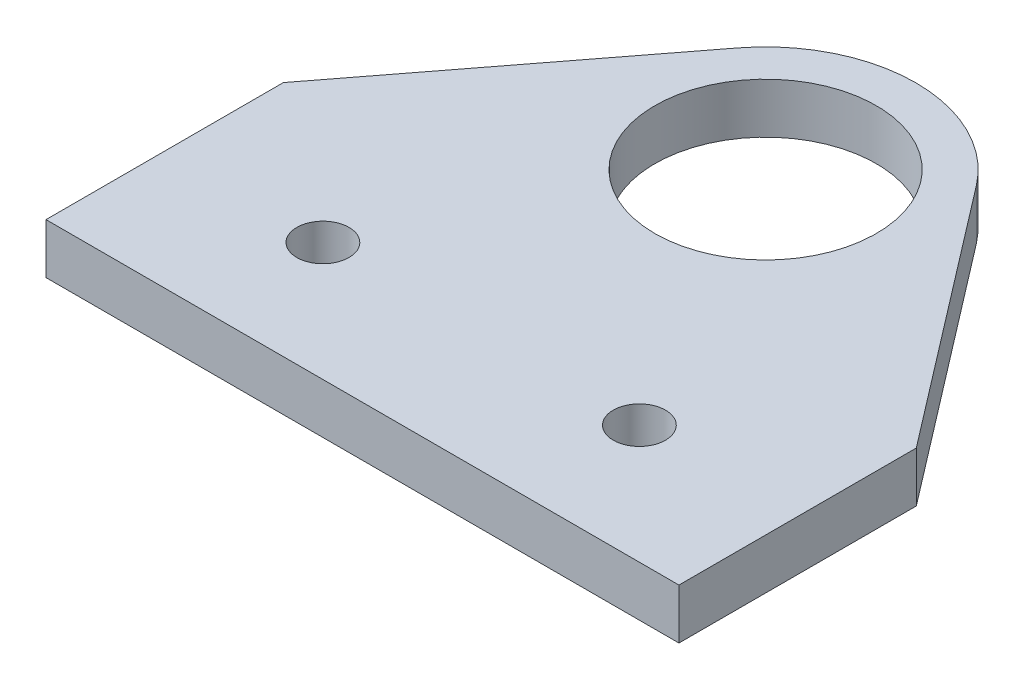
ISO-10303-21;
HEADER;
FILE_DESCRIPTION(('STEP AP214'),'2;1');
FILE_NAME('part.step','',(''),(''),'','','');
FILE_SCHEMA(('AUTOMOTIVE_DESIGN { 1 0 10303 214 1 1 1 1 }'));
ENDSEC;
DATA;
#1=APPLICATION_CONTEXT('core data for automotive mechanical design processes');
#2=APPLICATION_PROTOCOL_DEFINITION('international standard','automotive_design',2000,#1);
#3=PRODUCT_CONTEXT('',#1,'mechanical');
#4=PRODUCT('Part','Part','',(#3));
#5=PRODUCT_RELATED_PRODUCT_CATEGORY('part','',(#4));
#6=PRODUCT_DEFINITION_FORMATION('','',#4);
#7=PRODUCT_DEFINITION_CONTEXT('part definition',#1,'design');
#8=PRODUCT_DEFINITION('design','',#6,#7);
#9=PRODUCT_DEFINITION_SHAPE('','',#8);
#10=(LENGTH_UNIT() NAMED_UNIT(*) SI_UNIT(.MILLI.,.METRE.));
#11=(NAMED_UNIT(*) PLANE_ANGLE_UNIT() SI_UNIT($,.RADIAN.));
#12=(NAMED_UNIT(*) SI_UNIT($,.STERADIAN.) SOLID_ANGLE_UNIT());
#13=UNCERTAINTY_MEASURE_WITH_UNIT(LENGTH_MEASURE(1.E-05),#10,'distance_accuracy_value','');
#14=(GEOMETRIC_REPRESENTATION_CONTEXT(3) GLOBAL_UNCERTAINTY_ASSIGNED_CONTEXT((#13)) GLOBAL_UNIT_ASSIGNED_CONTEXT((#10,
#11,#12)) REPRESENTATION_CONTEXT('',''));
#15=CARTESIAN_POINT('',(0.,0.,0.));
#16=DIRECTION('',(0.,0.,1.));
#17=DIRECTION('',(1.,0.,0.));
#18=AXIS2_PLACEMENT_3D('',#15,#16,#17);
#19=CARTESIAN_POINT('',(0.,6.35,15.));
#20=DIRECTION('',(0.,0.,-1.));
#21=DIRECTION('',(-1.,0.,0.));
#22=AXIS2_PLACEMENT_3D('',#19,#20,#21);
#23=PLANE('',#22);
#24=DIRECTION('',(1.,0.,0.));
#25=VECTOR('',#24,1.);
#26=CARTESIAN_POINT('',(0.,0.,15.));
#27=LINE('',#26,#25);
#28=CARTESIAN_POINT('',(-40.,0.,15.));
#29=VERTEX_POINT('',#28);
#30=CARTESIAN_POINT('',(40.,0.,15.));
#31=VERTEX_POINT('',#30);
#32=EDGE_CURVE('E124',#29,#31,#27,.T.);
#33=ORIENTED_EDGE('',*,*,#32,.T.);
#34=DIRECTION('',(0.,-1.,0.));
#35=VECTOR('',#34,1.);
#36=CARTESIAN_POINT('',(40.,6.35,15.));
#37=LINE('',#36,#35);
#38=CARTESIAN_POINT('',(40.,6.35,15.));
#39=VERTEX_POINT('',#38);
#40=EDGE_CURVE('E11',#39,#31,#37,.T.);
#41=ORIENTED_EDGE('',*,*,#40,.F.);
#42=DIRECTION('',(1.,0.,0.));
#43=VECTOR('',#42,1.);
#44=CARTESIAN_POINT('',(0.,6.35,15.));
#45=LINE('',#44,#43);
#46=CARTESIAN_POINT('',(-40.,6.35,15.));
#47=VERTEX_POINT('',#46);
#48=EDGE_CURVE('E140',#47,#39,#45,.T.);
#49=ORIENTED_EDGE('',*,*,#48,.F.);
#50=DIRECTION('',(0.,-1.,0.));
#51=VECTOR('',#50,1.);
#52=CARTESIAN_POINT('',(-40.,6.35,15.));
#53=LINE('',#52,#51);
#54=EDGE_CURVE('E51',#47,#29,#53,.T.);
#55=ORIENTED_EDGE('',*,*,#54,.T.);
#56=EDGE_LOOP('',(#33,#41,#49,#55));
#57=FACE_BOUND('',#56,.T.);
#58=ADVANCED_FACE('F35',(#57),#23,.F.);
#59=CARTESIAN_POINT('',(40.,6.35,0.));
#60=DIRECTION('',(-1.,0.,0.));
#61=DIRECTION('',(0.,0.,1.));
#62=AXIS2_PLACEMENT_3D('',#59,#60,#61);
#63=PLANE('',#62);
#64=DIRECTION('',(0.,0.,-1.));
#65=VECTOR('',#64,1.);
#66=CARTESIAN_POINT('',(40.,0.,0.));
#67=LINE('',#66,#65);
#68=CARTESIAN_POINT('',(40.,0.,-15.));
#69=VERTEX_POINT('',#68);
#70=EDGE_CURVE('E126',#31,#69,#67,.T.);
#71=ORIENTED_EDGE('',*,*,#70,.T.);
#72=DIRECTION('',(0.,-1.,0.));
#73=VECTOR('',#72,1.);
#74=CARTESIAN_POINT('',(40.,6.35,-15.));
#75=LINE('',#74,#73);
#76=CARTESIAN_POINT('',(40.,6.35,-15.));
#77=VERTEX_POINT('',#76);
#78=EDGE_CURVE('E43',#77,#69,#75,.T.);
#79=ORIENTED_EDGE('',*,*,#78,.F.);
#80=DIRECTION('',(0.,0.,-1.));
#81=VECTOR('',#80,1.);
#82=CARTESIAN_POINT('',(40.,6.35,0.));
#83=LINE('',#82,#81);
#84=EDGE_CURVE('E83',#39,#77,#83,.T.);
#85=ORIENTED_EDGE('',*,*,#84,.F.);
#86=ORIENTED_EDGE('',*,*,#40,.T.);
#87=EDGE_LOOP('',(#71,#79,#85,#86));
#88=FACE_BOUND('',#87,.T.);
#89=ADVANCED_FACE('F162',(#88),#63,.F.);
#90=CARTESIAN_POINT('',(32.4372928552907,6.35,-24.865590874823));
#91=DIRECTION('',(-0.79364180564368,0.,0.608385309104879));
#92=DIRECTION('',(0.608385309104879,0.,0.79364180564368));
#93=AXIS2_PLACEMENT_3D('',#90,#91,#92);
#94=PLANE('',#93);
#95=DIRECTION('',(-0.608385309104879,0.,-0.79364180564368));
#96=VECTOR('',#95,1.);
#97=CARTESIAN_POINT('',(32.4372928552907,0.,-24.865590874823));
#98=LINE('',#97,#96);
#99=CARTESIAN_POINT('',(15.0791943072299,0.,-47.5093208729927));
#100=VERTEX_POINT('',#99);
#101=EDGE_CURVE('E129',#69,#100,#98,.T.);
#102=ORIENTED_EDGE('',*,*,#101,.T.);
#103=DIRECTION('',(0.,-1.,0.));
#104=VECTOR('',#103,1.);
#105=CARTESIAN_POINT('',(15.0791943072299,6.35,-47.5093208729927));
#106=LINE('',#105,#104);
#107=CARTESIAN_POINT('',(15.0791943072299,6.35,-47.5093208729927));
#108=VERTEX_POINT('',#107);
#109=EDGE_CURVE('E113',#108,#100,#106,.T.);
#110=ORIENTED_EDGE('',*,*,#109,.F.);
#111=DIRECTION('',(-0.608385309104879,0.,-0.79364180564368));
#112=VECTOR('',#111,1.);
#113=CARTESIAN_POINT('',(32.4372928552907,6.35,-24.865590874823));
#114=LINE('',#113,#112);
#115=EDGE_CURVE('E101',#77,#108,#114,.T.);
#116=ORIENTED_EDGE('',*,*,#115,.F.);
#117=ORIENTED_EDGE('',*,*,#78,.T.);
#118=EDGE_LOOP('',(#102,#110,#116,#117));
#119=FACE_BOUND('',#118,.T.);
#120=ADVANCED_FACE('F146',(#119),#94,.F.);
#121=CARTESIAN_POINT('',(0.,6.35,-35.95));
#122=DIRECTION('',(0.,-1.,0.));
#123=DIRECTION('',(0.,0.,-1.));
#124=AXIS2_PLACEMENT_3D('',#121,#122,#123);
#125=CYLINDRICAL_SURFACE('',#124,19.);
#126=CARTESIAN_POINT('',(0.,0.,-35.95));
#127=DIRECTION('',(0.,1.,0.));
#128=DIRECTION('',(0.,0.,1.));
#129=AXIS2_PLACEMENT_3D('',#126,#127,#128);
#130=CIRCLE('',#129,19.);
#131=CARTESIAN_POINT('',(-15.0791943072299,0.,-47.5093208729927));
#132=VERTEX_POINT('',#131);
#133=EDGE_CURVE('E110',#100,#132,#130,.T.);
#134=ORIENTED_EDGE('',*,*,#133,.T.);
#135=DIRECTION('',(0.,-1.,0.));
#136=VECTOR('',#135,1.);
#137=CARTESIAN_POINT('',(-15.0791943072299,6.35,-47.5093208729927));
#138=LINE('',#137,#136);
#139=CARTESIAN_POINT('',(-15.0791943072299,6.35,-47.5093208729927));
#140=VERTEX_POINT('',#139);
#141=EDGE_CURVE('E107',#140,#132,#138,.T.);
#142=ORIENTED_EDGE('',*,*,#141,.F.);
#143=CARTESIAN_POINT('',(0.,6.35,-35.95));
#144=DIRECTION('',(0.,1.,0.));
#145=DIRECTION('',(0.,0.,1.));
#146=AXIS2_PLACEMENT_3D('',#143,#144,#145);
#147=CIRCLE('',#146,19.);
#148=EDGE_CURVE('E93',#108,#140,#147,.T.);
#149=ORIENTED_EDGE('',*,*,#148,.F.);
#150=ORIENTED_EDGE('',*,*,#109,.T.);
#151=EDGE_LOOP('',(#134,#142,#149,#150));
#152=FACE_BOUND('',#151,.T.);
#153=ADVANCED_FACE('F108',(#152),#125,.T.);
#154=CARTESIAN_POINT('',(-32.4372928552907,6.35,-24.865590874823));
#155=DIRECTION('',(-0.79364180564368,0.,-0.608385309104879));
#156=DIRECTION('',(-0.608385309104879,0.,0.79364180564368));
#157=AXIS2_PLACEMENT_3D('',#154,#155,#156);
#158=PLANE('',#157);
#159=DIRECTION('',(0.608385309104879,0.,-0.79364180564368));
#160=VECTOR('',#159,1.);
#161=CARTESIAN_POINT('',(-32.4372928552907,0.,-24.865590874823));
#162=LINE('',#161,#160);
#163=CARTESIAN_POINT('',(-40.,0.,-15.));
#164=VERTEX_POINT('',#163);
#165=EDGE_CURVE('E132',#164,#132,#162,.T.);
#166=ORIENTED_EDGE('',*,*,#165,.F.);
#167=DIRECTION('',(0.,-1.,0.));
#168=VECTOR('',#167,1.);
#169=CARTESIAN_POINT('',(-40.,6.35,-15.));
#170=LINE('',#169,#168);
#171=CARTESIAN_POINT('',(-40.,6.35,-15.));
#172=VERTEX_POINT('',#171);
#173=EDGE_CURVE('E71',#172,#164,#170,.T.);
#174=ORIENTED_EDGE('',*,*,#173,.F.);
#175=DIRECTION('',(0.608385309104879,0.,-0.79364180564368));
#176=VECTOR('',#175,1.);
#177=CARTESIAN_POINT('',(-32.4372928552907,6.35,-24.865590874823));
#178=LINE('',#177,#176);
#179=EDGE_CURVE('E99',#172,#140,#178,.T.);
#180=ORIENTED_EDGE('',*,*,#179,.T.);
#181=ORIENTED_EDGE('',*,*,#141,.T.);
#182=EDGE_LOOP('',(#166,#174,#180,#181));
#183=FACE_BOUND('',#182,.T.);
#184=ADVANCED_FACE('F115',(#183),#158,.T.);
#185=CARTESIAN_POINT('',(-40.,6.35,0.));
#186=DIRECTION('',(-1.,0.,0.));
#187=DIRECTION('',(0.,0.,1.));
#188=AXIS2_PLACEMENT_3D('',#185,#186,#187);
#189=PLANE('',#188);
#190=DIRECTION('',(0.,0.,-1.));
#191=VECTOR('',#190,1.);
#192=CARTESIAN_POINT('',(-40.,0.,0.));
#193=LINE('',#192,#191);
#194=EDGE_CURVE('E134',#29,#164,#193,.T.);
#195=ORIENTED_EDGE('',*,*,#194,.F.);
#196=ORIENTED_EDGE('',*,*,#54,.F.);
#197=DIRECTION('',(0.,0.,-1.));
#198=VECTOR('',#197,1.);
#199=CARTESIAN_POINT('',(-40.,6.35,0.));
#200=LINE('',#199,#198);
#201=EDGE_CURVE('E116',#47,#172,#200,.T.);
#202=ORIENTED_EDGE('',*,*,#201,.T.);
#203=ORIENTED_EDGE('',*,*,#173,.T.);
#204=EDGE_LOOP('',(#195,#196,#202,#203));
#205=FACE_BOUND('',#204,.T.);
#206=ADVANCED_FACE('F150',(#205),#189,.T.);
#207=CARTESIAN_POINT('',(0.,6.35,-35.95));
#208=DIRECTION('',(0.,-1.,0.));
#209=DIRECTION('',(0.,0.,-1.));
#210=AXIS2_PLACEMENT_3D('',#207,#208,#209);
#211=CYLINDRICAL_SURFACE('',#210,14.);
#212=CARTESIAN_POINT('',(0.,6.35,-35.95));
#213=DIRECTION('',(0.,1.,0.));
#214=DIRECTION('',(0.,0.,1.));
#215=AXIS2_PLACEMENT_3D('',#212,#213,#214);
#216=CIRCLE('',#215,14.);
#217=CARTESIAN_POINT('',(0.,6.35,-21.95));
#218=VERTEX_POINT('',#217);
#219=EDGE_CURVE('E118',#218,#218,#216,.T.);
#220=ORIENTED_EDGE('',*,*,#219,.T.);
#221=EDGE_LOOP('',(#220));
#222=FACE_BOUND('',#221,.T.);
#223=CARTESIAN_POINT('',(0.,0.,-35.95));
#224=DIRECTION('',(0.,1.,0.));
#225=DIRECTION('',(0.,0.,1.));
#226=AXIS2_PLACEMENT_3D('',#223,#224,#225);
#227=CIRCLE('',#226,14.);
#228=CARTESIAN_POINT('',(0.,0.,-21.95));
#229=VERTEX_POINT('',#228);
#230=EDGE_CURVE('E137',#229,#229,#227,.T.);
#231=ORIENTED_EDGE('',*,*,#230,.F.);
#232=EDGE_LOOP('',(#231));
#233=FACE_BOUND('',#232,.T.);
#234=ADVANCED_FACE('F152',(#222,#233),#211,.F.);
#235=CARTESIAN_POINT('',(0.,6.35,0.));
#236=DIRECTION('',(0.,1.,0.));
#237=DIRECTION('',(0.,0.,1.));
#238=AXIS2_PLACEMENT_3D('',#235,#236,#237);
#239=PLANE('',#238);
#240=CARTESIAN_POINT('',(-20.,6.35,0.));
#241=DIRECTION('',(0.,1.,0.));
#242=DIRECTION('',(0.,0.,1.));
#243=AXIS2_PLACEMENT_3D('',#240,#241,#242);
#244=CIRCLE('',#243,3.29999999999999);
#245=CARTESIAN_POINT('',(-20.,6.35,3.29999999999999));
#246=VERTEX_POINT('',#245);
#247=EDGE_CURVE('E178',#246,#246,#244,.T.);
#248=ORIENTED_EDGE('',*,*,#247,.F.);
#249=EDGE_LOOP('',(#248));
#250=FACE_BOUND('',#249,.T.);
#251=CARTESIAN_POINT('',(20.,6.35,0.));
#252=DIRECTION('',(0.,1.,0.));
#253=DIRECTION('',(0.,0.,1.));
#254=AXIS2_PLACEMENT_3D('',#251,#252,#253);
#255=CIRCLE('',#254,3.29999999999999);
#256=CARTESIAN_POINT('',(20.,6.35,3.29999999999999));
#257=VERTEX_POINT('',#256);
#258=EDGE_CURVE('E172',#257,#257,#255,.T.);
#259=ORIENTED_EDGE('',*,*,#258,.F.);
#260=EDGE_LOOP('',(#259));
#261=FACE_BOUND('',#260,.T.);
#262=ORIENTED_EDGE('',*,*,#48,.T.);
#263=ORIENTED_EDGE('',*,*,#84,.T.);
#264=ORIENTED_EDGE('',*,*,#115,.T.);
#265=ORIENTED_EDGE('',*,*,#148,.T.);
#266=ORIENTED_EDGE('',*,*,#179,.F.);
#267=ORIENTED_EDGE('',*,*,#201,.F.);
#268=EDGE_LOOP('',(#262,#263,#264,#265,#266,#267));
#269=FACE_BOUND('',#268,.T.);
#270=ORIENTED_EDGE('',*,*,#219,.F.);
#271=EDGE_LOOP('',(#270));
#272=FACE_BOUND('',#271,.T.);
#273=ADVANCED_FACE('F95',(#250,#261,#269,#272),#239,.T.);
#274=CARTESIAN_POINT('',(0.,0.,0.));
#275=DIRECTION('',(0.,1.,0.));
#276=DIRECTION('',(0.,0.,1.));
#277=AXIS2_PLACEMENT_3D('',#274,#275,#276);
#278=PLANE('',#277);
#279=CARTESIAN_POINT('',(-20.,0.,0.));
#280=DIRECTION('',(0.,1.,0.));
#281=DIRECTION('',(0.,0.,1.));
#282=AXIS2_PLACEMENT_3D('',#279,#280,#281);
#283=CIRCLE('',#282,3.3);
#284=CARTESIAN_POINT('',(-20.,0.,3.3));
#285=VERTEX_POINT('',#284);
#286=EDGE_CURVE('E175',#285,#285,#283,.T.);
#287=ORIENTED_EDGE('',*,*,#286,.T.);
#288=EDGE_LOOP('',(#287));
#289=FACE_BOUND('',#288,.T.);
#290=CARTESIAN_POINT('',(20.,0.,0.));
#291=DIRECTION('',(0.,1.,0.));
#292=DIRECTION('',(0.,0.,1.));
#293=AXIS2_PLACEMENT_3D('',#290,#291,#292);
#294=CIRCLE('',#293,3.3);
#295=CARTESIAN_POINT('',(20.,0.,3.3));
#296=VERTEX_POINT('',#295);
#297=EDGE_CURVE('E127',#296,#296,#294,.T.);
#298=ORIENTED_EDGE('',*,*,#297,.T.);
#299=EDGE_LOOP('',(#298));
#300=FACE_BOUND('',#299,.T.);
#301=ORIENTED_EDGE('',*,*,#32,.F.);
#302=ORIENTED_EDGE('',*,*,#194,.T.);
#303=ORIENTED_EDGE('',*,*,#165,.T.);
#304=ORIENTED_EDGE('',*,*,#133,.F.);
#305=ORIENTED_EDGE('',*,*,#101,.F.);
#306=ORIENTED_EDGE('',*,*,#70,.F.);
#307=EDGE_LOOP('',(#301,#302,#303,#304,#305,#306));
#308=FACE_BOUND('',#307,.T.);
#309=ORIENTED_EDGE('',*,*,#230,.T.);
#310=EDGE_LOOP('',(#309));
#311=FACE_BOUND('',#310,.T.);
#312=ADVANCED_FACE('F148',(#289,#300,#308,#311),#278,.F.);
#313=CARTESIAN_POINT('',(20.,6.35,0.));
#314=DIRECTION('',(0.,1.,0.));
#315=DIRECTION('',(0.,0.,1.));
#316=AXIS2_PLACEMENT_3D('',#313,#314,#315);
#317=CYLINDRICAL_SURFACE('',#316,3.29999999999999);
#318=ORIENTED_EDGE('',*,*,#297,.F.);
#319=EDGE_LOOP('',(#318));
#320=FACE_BOUND('',#319,.T.);
#321=ORIENTED_EDGE('',*,*,#258,.T.);
#322=EDGE_LOOP('',(#321));
#323=FACE_BOUND('',#322,.T.);
#324=ADVANCED_FACE('F189',(#320,#323),#317,.F.);
#325=CARTESIAN_POINT('',(-20.,6.35,0.));
#326=DIRECTION('',(0.,1.,0.));
#327=DIRECTION('',(0.,0.,1.));
#328=AXIS2_PLACEMENT_3D('',#325,#326,#327);
#329=CYLINDRICAL_SURFACE('',#328,3.29999999999999);
#330=ORIENTED_EDGE('',*,*,#286,.F.);
#331=EDGE_LOOP('',(#330));
#332=FACE_BOUND('',#331,.T.);
#333=ORIENTED_EDGE('',*,*,#247,.T.);
#334=EDGE_LOOP('',(#333));
#335=FACE_BOUND('',#334,.T.);
#336=ADVANCED_FACE('F182',(#332,#335),#329,.F.);
#337=CLOSED_SHELL('',(#58,#89,#120,#153,#184,#206,#234,#273,#312,#324,#336));
#338=MANIFOLD_SOLID_BREP('B2',#337);
#339=ADVANCED_BREP_SHAPE_REPRESENTATION('',(#18,#338),#14);
#340=SHAPE_DEFINITION_REPRESENTATION(#9,#339);
ENDSEC;
END-ISO-10303-21;
